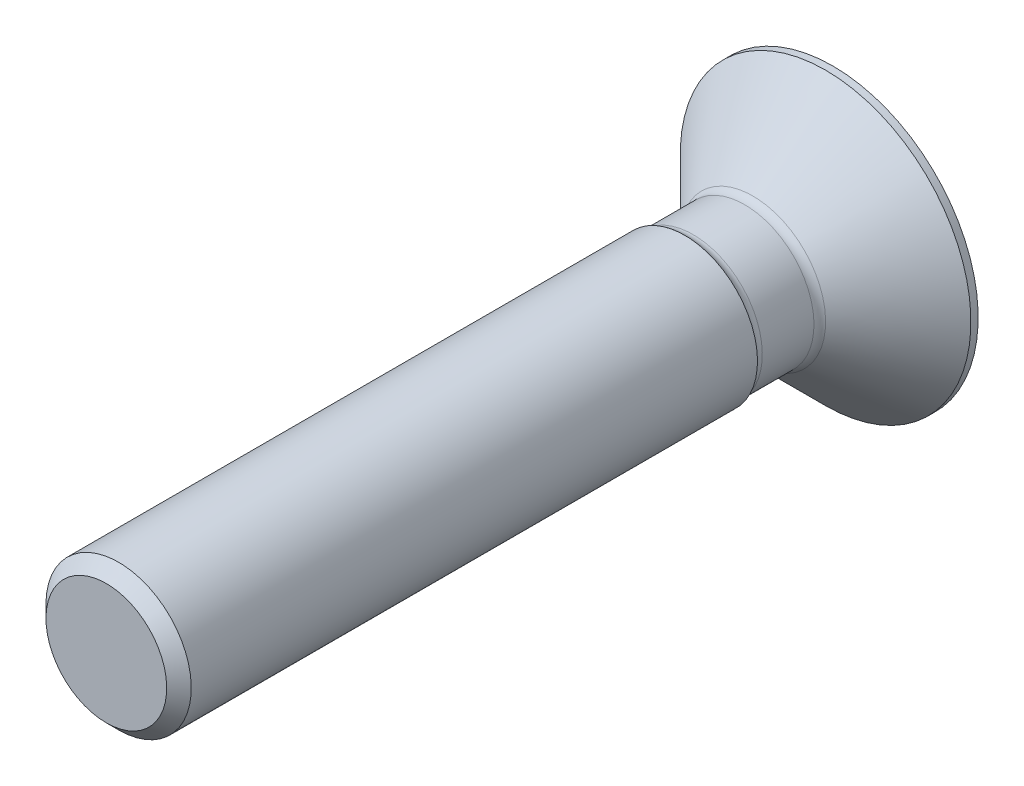
ISO-10303-21;
HEADER;
FILE_DESCRIPTION(('STEP AP214'),'2;1');
FILE_NAME('part.step','',(''),(''),'','','');
FILE_SCHEMA(('AUTOMOTIVE_DESIGN { 1 0 10303 214 1 1 1 1 }'));
ENDSEC;
DATA;
#1=APPLICATION_CONTEXT('core data for automotive mechanical design processes');
#2=APPLICATION_PROTOCOL_DEFINITION('international standard','automotive_design',2000,#1);
#3=PRODUCT_CONTEXT('',#1,'mechanical');
#4=PRODUCT('Part','Part','',(#3));
#5=PRODUCT_RELATED_PRODUCT_CATEGORY('part','',(#4));
#6=PRODUCT_DEFINITION_FORMATION('','',#4);
#7=PRODUCT_DEFINITION_CONTEXT('part definition',#1,'design');
#8=PRODUCT_DEFINITION('design','',#6,#7);
#9=PRODUCT_DEFINITION_SHAPE('','',#8);
#10=(LENGTH_UNIT() NAMED_UNIT(*) SI_UNIT(.MILLI.,.METRE.));
#11=(NAMED_UNIT(*) PLANE_ANGLE_UNIT() SI_UNIT($,.RADIAN.));
#12=(NAMED_UNIT(*) SI_UNIT($,.STERADIAN.) SOLID_ANGLE_UNIT());
#13=UNCERTAINTY_MEASURE_WITH_UNIT(LENGTH_MEASURE(1.E-05),#10,'distance_accuracy_value','');
#14=(GEOMETRIC_REPRESENTATION_CONTEXT(3) GLOBAL_UNCERTAINTY_ASSIGNED_CONTEXT((#13)) GLOBAL_UNIT_ASSIGNED_CONTEXT((#10,
#11,#12)) REPRESENTATION_CONTEXT('',''));
#15=CARTESIAN_POINT('',(0.,0.,0.));
#16=DIRECTION('',(0.,0.,1.));
#17=DIRECTION('',(1.,0.,0.));
#18=AXIS2_PLACEMENT_3D('',#15,#16,#17);
#19=CARTESIAN_POINT('',(0.,-1.66171875,35.6));
#20=DIRECTION('',(0.,0.,1.));
#21=DIRECTION('',(0.,-1.,0.));
#22=AXIS2_PLACEMENT_3D('',#19,#20,#21);
#23=PLANE('',#22);
#24=CARTESIAN_POINT('',(0.,0.,35.6));
#25=DIRECTION('',(0.,0.,1.));
#26=DIRECTION('',(0.,-1.,0.));
#27=AXIS2_PLACEMENT_3D('',#24,#25,#26);
#28=CIRCLE('',#27,3.3234375);
#29=CARTESIAN_POINT('',(0.,-3.3234375,35.6));
#30=VERTEX_POINT('',#29);
#31=EDGE_CURVE('E11',#30,#30,#28,.T.);
#32=ORIENTED_EDGE('',*,*,#31,.T.);
#33=EDGE_LOOP('',(#32));
#34=FACE_BOUND('',#33,.T.);
#35=ADVANCED_FACE('F17',(#34),#23,.T.);
#36=CARTESIAN_POINT('',(0.,0.,35.26171875));
#37=DIRECTION('',(0.,0.,-1.));
#38=DIRECTION('',(0.,-1.,0.));
#39=AXIS2_PLACEMENT_3D('',#36,#37,#38);
#40=CONICAL_SURFACE('',#39,3.66171875,0.785398163397446);
#41=CARTESIAN_POINT('',(0.,0.,34.9234375));
#42=DIRECTION('',(0.,0.,1.));
#43=DIRECTION('',(0.,-1.,0.));
#44=AXIS2_PLACEMENT_3D('',#41,#42,#43);
#45=CIRCLE('',#44,4.);
#46=CARTESIAN_POINT('',(0.,-4.,34.9234375));
#47=VERTEX_POINT('',#46);
#48=EDGE_CURVE('E27',#47,#47,#45,.T.);
#49=ORIENTED_EDGE('',*,*,#48,.T.);
#50=EDGE_LOOP('',(#49));
#51=FACE_BOUND('',#50,.T.);
#52=ORIENTED_EDGE('',*,*,#31,.F.);
#53=EDGE_LOOP('',(#52));
#54=FACE_BOUND('',#53,.T.);
#55=ADVANCED_FACE('F224',(#51,#54),#40,.T.);
#56=CARTESIAN_POINT('',(0.,0.,19.33671875));
#57=DIRECTION('',(0.,0.,-1.));
#58=DIRECTION('',(0.,-1.,0.));
#59=AXIS2_PLACEMENT_3D('',#56,#57,#58);
#60=CYLINDRICAL_SURFACE('',#59,4.);
#61=CARTESIAN_POINT('',(0.,0.,3.75));
#62=DIRECTION('',(0.,0.,1.));
#63=DIRECTION('',(0.,-1.,0.));
#64=AXIS2_PLACEMENT_3D('',#61,#62,#63);
#65=CIRCLE('',#64,4.);
#66=CARTESIAN_POINT('',(0.,-4.,3.75));
#67=VERTEX_POINT('',#66);
#68=EDGE_CURVE('E93',#67,#67,#65,.T.);
#69=ORIENTED_EDGE('',*,*,#68,.T.);
#70=EDGE_LOOP('',(#69));
#71=FACE_BOUND('',#70,.T.);
#72=ORIENTED_EDGE('',*,*,#48,.F.);
#73=EDGE_LOOP('',(#72));
#74=FACE_BOUND('',#73,.T.);
#75=ADVANCED_FACE('F94',(#71,#74),#60,.T.);
#76=CARTESIAN_POINT('',(0.,0.,3.2974516600406));
#77=DIRECTION('',(0.,0.,1.));
#78=DIRECTION('',(-1.,0.,0.));
#79=AXIS2_PLACEMENT_3D('',#76,#77,#78);
#80=TOROIDAL_SURFACE('',#79,4.4525483399594,0.64);
#81=CARTESIAN_POINT('',(0.,0.,3.2974516600406));
#82=DIRECTION('',(0.,0.,1.));
#83=DIRECTION('',(0.,-1.,0.));
#84=AXIS2_PLACEMENT_3D('',#81,#82,#83);
#85=CIRCLE('',#84,3.81254833995939);
#86=CARTESIAN_POINT('',(0.,-3.81254833995939,3.2974516600406));
#87=VERTEX_POINT('',#86);
#88=EDGE_CURVE('E89',#87,#87,#85,.T.);
#89=ORIENTED_EDGE('',*,*,#88,.T.);
#90=EDGE_LOOP('',(#89));
#91=FACE_BOUND('',#90,.T.);
#92=ORIENTED_EDGE('',*,*,#68,.F.);
#93=EDGE_LOOP('',(#92));
#94=FACE_BOUND('',#93,.T.);
#95=ADVANCED_FACE('F244',(#91,#94),#80,.F.);
#96=CARTESIAN_POINT('',(0.,0.,1.875));
#97=DIRECTION('',(0.,0.,-1.));
#98=DIRECTION('',(0.,-1.,0.));
#99=AXIS2_PLACEMENT_3D('',#96,#97,#98);
#100=CYLINDRICAL_SURFACE('',#99,3.81254833995939);
#101=CARTESIAN_POINT('',(0.,0.,0.452548339959391));
#102=DIRECTION('',(0.,0.,1.));
#103=DIRECTION('',(0.,-1.,0.));
#104=AXIS2_PLACEMENT_3D('',#101,#102,#103);
#105=CIRCLE('',#104,3.81254833995939);
#106=CARTESIAN_POINT('',(0.,-3.81254833995939,0.452548339959391));
#107=VERTEX_POINT('',#106);
#108=EDGE_CURVE('E98',#107,#107,#105,.T.);
#109=ORIENTED_EDGE('',*,*,#108,.T.);
#110=EDGE_LOOP('',(#109));
#111=FACE_BOUND('',#110,.T.);
#112=ORIENTED_EDGE('',*,*,#88,.F.);
#113=EDGE_LOOP('',(#112));
#114=FACE_BOUND('',#113,.T.);
#115=ADVANCED_FACE('F239',(#111,#114),#100,.T.);
#116=CARTESIAN_POINT('',(0.,0.,0.45254833995939));
#117=DIRECTION('',(0.,0.,1.));
#118=DIRECTION('',(-1.,0.,0.));
#119=AXIS2_PLACEMENT_3D('',#116,#117,#118);
#120=TOROIDAL_SURFACE('',#119,4.45254833995939,0.64);
#121=CARTESIAN_POINT('',(0.,0.,0.));
#122=DIRECTION('',(0.,0.,1.));
#123=DIRECTION('',(0.,-1.,0.));
#124=AXIS2_PLACEMENT_3D('',#121,#122,#123);
#125=CIRCLE('',#124,4.);
#126=CARTESIAN_POINT('',(0.,-4.,0.));
#127=VERTEX_POINT('',#126);
#128=EDGE_CURVE('E130',#127,#127,#125,.T.);
#129=ORIENTED_EDGE('',*,*,#128,.T.);
#130=EDGE_LOOP('',(#129));
#131=FACE_BOUND('',#130,.T.);
#132=ORIENTED_EDGE('',*,*,#108,.F.);
#133=EDGE_LOOP('',(#132));
#134=FACE_BOUND('',#133,.T.);
#135=ADVANCED_FACE('F236',(#131,#134),#120,.F.);
#136=CARTESIAN_POINT('',(0.,0.,-2.));
#137=DIRECTION('',(0.,0.,-1.));
#138=DIRECTION('',(0.,-1.,0.));
#139=AXIS2_PLACEMENT_3D('',#136,#137,#138);
#140=CONICAL_SURFACE('',#139,6.,0.785398163397449);
#141=CARTESIAN_POINT('',(0.,0.,-4.));
#142=DIRECTION('',(0.,0.,1.));
#143=DIRECTION('',(0.,-1.,0.));
#144=AXIS2_PLACEMENT_3D('',#141,#142,#143);
#145=CIRCLE('',#144,8.);
#146=CARTESIAN_POINT('',(0.,-8.,-4.));
#147=VERTEX_POINT('',#146);
#148=EDGE_CURVE('E128',#147,#147,#145,.T.);
#149=ORIENTED_EDGE('',*,*,#148,.T.);
#150=EDGE_LOOP('',(#149));
#151=FACE_BOUND('',#150,.T.);
#152=ORIENTED_EDGE('',*,*,#128,.F.);
#153=EDGE_LOOP('',(#152));
#154=FACE_BOUND('',#153,.T.);
#155=ADVANCED_FACE('F19',(#151,#154),#140,.T.);
#156=CARTESIAN_POINT('',(0.,0.,-4.2));
#157=DIRECTION('',(0.,0.,-1.));
#158=DIRECTION('',(0.,-1.,0.));
#159=AXIS2_PLACEMENT_3D('',#156,#157,#158);
#160=CYLINDRICAL_SURFACE('',#159,8.);
#161=CARTESIAN_POINT('',(0.,0.,-4.4));
#162=DIRECTION('',(0.,0.,1.));
#163=DIRECTION('',(0.,-1.,0.));
#164=AXIS2_PLACEMENT_3D('',#161,#162,#163);
#165=CIRCLE('',#164,8.);
#166=CARTESIAN_POINT('',(0.,-8.,-4.4));
#167=VERTEX_POINT('',#166);
#168=EDGE_CURVE('E131',#167,#167,#165,.T.);
#169=ORIENTED_EDGE('',*,*,#168,.T.);
#170=EDGE_LOOP('',(#169));
#171=FACE_BOUND('',#170,.T.);
#172=ORIENTED_EDGE('',*,*,#148,.F.);
#173=EDGE_LOOP('',(#172));
#174=FACE_BOUND('',#173,.T.);
#175=ADVANCED_FACE('F257',(#171,#174),#160,.T.);
#176=CARTESIAN_POINT('',(0.,-4.,-4.4));
#177=DIRECTION('',(0.,0.,-1.));
#178=DIRECTION('',(0.,1.,0.));
#179=AXIS2_PLACEMENT_3D('',#176,#177,#178);
#180=PLANE('',#179);
#181=ORIENTED_EDGE('',*,*,#168,.F.);
#182=EDGE_LOOP('',(#181));
#183=FACE_BOUND('',#182,.T.);
#184=DIRECTION('',(-0.5,-0.866025403784439,0.));
#185=VECTOR('',#184,1.);
#186=CARTESIAN_POINT('',(-3.03165040378444,-0.249675823286216,-4.4));
#187=LINE('',#186,#185);
#188=CARTESIAN_POINT('',(-1.44375,2.50064835342757,-4.4));
#189=VERTEX_POINT('',#188);
#190=CARTESIAN_POINT('',(-2.8875,0.,-4.4));
#191=VERTEX_POINT('',#190);
#192=EDGE_CURVE('E21',#189,#191,#187,.T.);
#193=ORIENTED_EDGE('',*,*,#192,.T.);
#194=DIRECTION('',(0.5,-0.866025403784439,0.));
#195=VECTOR('',#194,1.);
#196=CARTESIAN_POINT('',(-1.29959959621556,-2.75032417671378,-4.4));
#197=LINE('',#196,#195);
#198=CARTESIAN_POINT('',(-1.44375,-2.50064835342757,-4.4));
#199=VERTEX_POINT('',#198);
#200=EDGE_CURVE('E159',#191,#199,#197,.T.);
#201=ORIENTED_EDGE('',*,*,#200,.T.);
#202=DIRECTION('',(1.,0.,0.));
#203=VECTOR('',#202,1.);
#204=CARTESIAN_POINT('',(0.,-2.50064835342757,-4.4));
#205=LINE('',#204,#203);
#206=CARTESIAN_POINT('',(1.44375,-2.50064835342757,-4.4));
#207=VERTEX_POINT('',#206);
#208=EDGE_CURVE('E112',#199,#207,#205,.T.);
#209=ORIENTED_EDGE('',*,*,#208,.T.);
#210=DIRECTION('',(0.5,0.866025403784439,0.));
#211=VECTOR('',#210,1.);
#212=CARTESIAN_POINT('',(1.29959959621556,-2.75032417671378,-4.4));
#213=LINE('',#212,#211);
#214=CARTESIAN_POINT('',(2.8875,0.,-4.4));
#215=VERTEX_POINT('',#214);
#216=EDGE_CURVE('E113',#207,#215,#213,.T.);
#217=ORIENTED_EDGE('',*,*,#216,.T.);
#218=DIRECTION('',(-0.5,0.866025403784439,0.));
#219=VECTOR('',#218,1.);
#220=CARTESIAN_POINT('',(3.03165040378444,-0.249675823286217,-4.4));
#221=LINE('',#220,#219);
#222=CARTESIAN_POINT('',(1.44375,2.50064835342757,-4.4));
#223=VERTEX_POINT('',#222);
#224=EDGE_CURVE('E116',#215,#223,#221,.T.);
#225=ORIENTED_EDGE('',*,*,#224,.T.);
#226=DIRECTION('',(-1.,0.,0.));
#227=VECTOR('',#226,1.);
#228=CARTESIAN_POINT('',(0.,2.50064835342757,-4.4));
#229=LINE('',#228,#227);
#230=EDGE_CURVE('E117',#223,#189,#229,.T.);
#231=ORIENTED_EDGE('',*,*,#230,.T.);
#232=EDGE_LOOP('',(#193,#201,#209,#217,#225,#231));
#233=FACE_BOUND('',#232,.T.);
#234=ADVANCED_FACE('F182',(#183,#233),#180,.T.);
#235=CARTESIAN_POINT('',(-2.165625,-1.25032417671378,-4.4));
#236=DIRECTION('',(-0.866025403784439,-0.5,0.));
#237=DIRECTION('',(0.5,-0.866025403784439,0.));
#238=AXIS2_PLACEMENT_3D('',#235,#236,#237);
#239=PLANE('',#238);
#240=CARTESIAN_POINT('',(-2.8875,0.,-0.9));
#241=CARTESIAN_POINT('',(-2.165625,-1.25032417671378,-0.483225274428739));
#242=CARTESIAN_POINT('',(-1.44375,-2.50064835342757,-0.9));
#243=(BOUNDED_CURVE() B_SPLINE_CURVE(2,(#240,#241,#242),.UNSPECIFIED.,.F.,
.F.) B_SPLINE_CURVE_WITH_KNOTS((3,3),(0.,2.92184790476981),
.UNSPECIFIED.) CURVE() GEOMETRIC_REPRESENTATION_ITEM() RATIONAL_B_SPLINE_CURVE((1.,
1.15470053837925,1.)) REPRESENTATION_ITEM(''));
#244=CARTESIAN_POINT('',(-2.8875,0.,-0.9));
#245=VERTEX_POINT('',#244);
#246=CARTESIAN_POINT('',(-1.44375,-2.50064835342757,-0.9));
#247=VERTEX_POINT('',#246);
#248=EDGE_CURVE('E107',#245,#247,#243,.T.);
#249=ORIENTED_EDGE('',*,*,#248,.T.);
#250=DIRECTION('',(0.,0.,1.));
#251=VECTOR('',#250,1.);
#252=CARTESIAN_POINT('',(-1.44375,-2.50064835342757,-4.4));
#253=LINE('',#252,#251);
#254=EDGE_CURVE('E142',#199,#247,#253,.T.);
#255=ORIENTED_EDGE('',*,*,#254,.F.);
#256=ORIENTED_EDGE('',*,*,#200,.F.);
#257=DIRECTION('',(0.,0.,1.));
#258=VECTOR('',#257,1.);
#259=CARTESIAN_POINT('',(-2.8875,0.,-4.4));
#260=LINE('',#259,#258);
#261=EDGE_CURVE('E166',#191,#245,#260,.T.);
#262=ORIENTED_EDGE('',*,*,#261,.T.);
#263=EDGE_LOOP('',(#249,#255,#256,#262));
#264=FACE_BOUND('',#263,.T.);
#265=ADVANCED_FACE('F187',(#264),#239,.F.);
#266=CARTESIAN_POINT('',(0.,-2.50064835342757,-4.4));
#267=DIRECTION('',(0.,-1.,0.));
#268=DIRECTION('',(1.,0.,0.));
#269=AXIS2_PLACEMENT_3D('',#266,#267,#268);
#270=PLANE('',#269);
#271=CARTESIAN_POINT('',(-1.44375,-2.50064835342757,-0.9));
#272=CARTESIAN_POINT('',(0.,-2.50064835342756,-0.483225274428738));
#273=CARTESIAN_POINT('',(1.44375,-2.50064835342757,-0.9));
#274=(BOUNDED_CURVE() B_SPLINE_CURVE(2,(#271,#272,#273),.UNSPECIFIED.,.F.,
.F.) B_SPLINE_CURVE_WITH_KNOTS((3,3),(0.,2.92184790476982),
.UNSPECIFIED.) CURVE() GEOMETRIC_REPRESENTATION_ITEM() RATIONAL_B_SPLINE_CURVE((1.,
1.15470053837925,1.)) REPRESENTATION_ITEM(''));
#275=CARTESIAN_POINT('',(1.44375,-2.50064835342757,-0.9));
#276=VERTEX_POINT('',#275);
#277=EDGE_CURVE('E118',#247,#276,#274,.T.);
#278=ORIENTED_EDGE('',*,*,#277,.T.);
#279=DIRECTION('',(0.,0.,1.));
#280=VECTOR('',#279,1.);
#281=CARTESIAN_POINT('',(1.44375,-2.50064835342757,-4.4));
#282=LINE('',#281,#280);
#283=EDGE_CURVE('E65',#207,#276,#282,.T.);
#284=ORIENTED_EDGE('',*,*,#283,.F.);
#285=ORIENTED_EDGE('',*,*,#208,.F.);
#286=ORIENTED_EDGE('',*,*,#254,.T.);
#287=EDGE_LOOP('',(#278,#284,#285,#286));
#288=FACE_BOUND('',#287,.T.);
#289=ADVANCED_FACE('F191',(#288),#270,.F.);
#290=CARTESIAN_POINT('',(2.165625,-1.25032417671378,-4.4));
#291=DIRECTION('',(0.866025403784439,-0.5,0.));
#292=DIRECTION('',(0.5,0.866025403784439,0.));
#293=AXIS2_PLACEMENT_3D('',#290,#291,#292);
#294=PLANE('',#293);
#295=CARTESIAN_POINT('',(1.44375,-2.50064835342757,-0.9));
#296=CARTESIAN_POINT('',(2.165625,-1.25032417671378,-0.48322527442874));
#297=CARTESIAN_POINT('',(2.8875,0.,-0.9));
#298=(BOUNDED_CURVE() B_SPLINE_CURVE(2,(#295,#296,#297),.UNSPECIFIED.,.F.,
.F.) B_SPLINE_CURVE_WITH_KNOTS((3,3),(0.,2.9218479047698),
.UNSPECIFIED.) CURVE() GEOMETRIC_REPRESENTATION_ITEM() RATIONAL_B_SPLINE_CURVE((1.,
1.15470053837925,1.)) REPRESENTATION_ITEM(''));
#299=CARTESIAN_POINT('',(2.8875,0.,-0.9));
#300=VERTEX_POINT('',#299);
#301=EDGE_CURVE('E122',#276,#300,#298,.T.);
#302=ORIENTED_EDGE('',*,*,#301,.T.);
#303=DIRECTION('',(0.,0.,1.));
#304=VECTOR('',#303,1.);
#305=CARTESIAN_POINT('',(2.8875,0.,-4.4));
#306=LINE('',#305,#304);
#307=EDGE_CURVE('E123',#215,#300,#306,.T.);
#308=ORIENTED_EDGE('',*,*,#307,.F.);
#309=ORIENTED_EDGE('',*,*,#216,.F.);
#310=ORIENTED_EDGE('',*,*,#283,.T.);
#311=EDGE_LOOP('',(#302,#308,#309,#310));
#312=FACE_BOUND('',#311,.T.);
#313=ADVANCED_FACE('F195',(#312),#294,.F.);
#314=CARTESIAN_POINT('',(2.165625,1.25032417671378,-4.4));
#315=DIRECTION('',(0.866025403784439,0.5,0.));
#316=DIRECTION('',(-0.5,0.866025403784439,0.));
#317=AXIS2_PLACEMENT_3D('',#314,#315,#316);
#318=PLANE('',#317);
#319=CARTESIAN_POINT('',(2.8875,0.,-0.9));
#320=CARTESIAN_POINT('',(2.165625,1.25032417671378,-0.48322527442874));
#321=CARTESIAN_POINT('',(1.44375,2.50064835342757,-0.9));
#322=(BOUNDED_CURVE() B_SPLINE_CURVE(2,(#319,#320,#321),.UNSPECIFIED.,.F.,
.F.) B_SPLINE_CURVE_WITH_KNOTS((3,3),(0.,2.9218479047698),
.UNSPECIFIED.) CURVE() GEOMETRIC_REPRESENTATION_ITEM() RATIONAL_B_SPLINE_CURVE((1.,
1.15470053837925,1.)) REPRESENTATION_ITEM(''));
#323=CARTESIAN_POINT('',(1.44375,2.50064835342757,-0.9));
#324=VERTEX_POINT('',#323);
#325=EDGE_CURVE('E136',#300,#324,#322,.T.);
#326=ORIENTED_EDGE('',*,*,#325,.T.);
#327=DIRECTION('',(0.,0.,1.));
#328=VECTOR('',#327,1.);
#329=CARTESIAN_POINT('',(1.44375,2.50064835342757,-4.4));
#330=LINE('',#329,#328);
#331=EDGE_CURVE('E114',#223,#324,#330,.T.);
#332=ORIENTED_EDGE('',*,*,#331,.F.);
#333=ORIENTED_EDGE('',*,*,#224,.F.);
#334=ORIENTED_EDGE('',*,*,#307,.T.);
#335=EDGE_LOOP('',(#326,#332,#333,#334));
#336=FACE_BOUND('',#335,.T.);
#337=ADVANCED_FACE('F212',(#336),#318,.F.);
#338=CARTESIAN_POINT('',(0.,2.50064835342757,-4.4));
#339=DIRECTION('',(0.,1.,0.));
#340=DIRECTION('',(-1.,0.,0.));
#341=AXIS2_PLACEMENT_3D('',#338,#339,#340);
#342=PLANE('',#341);
#343=CARTESIAN_POINT('',(1.44375,2.50064835342757,-0.9));
#344=CARTESIAN_POINT('',(0.,2.50064835342756,-0.483225274428739));
#345=CARTESIAN_POINT('',(-1.44375,2.50064835342757,-0.9));
#346=(BOUNDED_CURVE() B_SPLINE_CURVE(2,(#343,#344,#345),.UNSPECIFIED.,.F.,
.F.) B_SPLINE_CURVE_WITH_KNOTS((3,3),(0.,2.92184790476981),
.UNSPECIFIED.) CURVE() GEOMETRIC_REPRESENTATION_ITEM() RATIONAL_B_SPLINE_CURVE((1.,
1.15470053837925,1.)) REPRESENTATION_ITEM(''));
#347=CARTESIAN_POINT('',(-1.44375,2.50064835342757,-0.9));
#348=VERTEX_POINT('',#347);
#349=EDGE_CURVE('E106',#324,#348,#346,.T.);
#350=ORIENTED_EDGE('',*,*,#349,.T.);
#351=DIRECTION('',(0.,0.,1.));
#352=VECTOR('',#351,1.);
#353=CARTESIAN_POINT('',(-1.44375,2.50064835342757,-4.4));
#354=LINE('',#353,#352);
#355=EDGE_CURVE('E171',#189,#348,#354,.T.);
#356=ORIENTED_EDGE('',*,*,#355,.F.);
#357=ORIENTED_EDGE('',*,*,#230,.F.);
#358=ORIENTED_EDGE('',*,*,#331,.T.);
#359=EDGE_LOOP('',(#350,#356,#357,#358));
#360=FACE_BOUND('',#359,.T.);
#361=ADVANCED_FACE('F207',(#360),#342,.F.);
#362=CARTESIAN_POINT('',(-2.165625,1.25032417671378,-4.4));
#363=DIRECTION('',(-0.866025403784439,0.5,0.));
#364=DIRECTION('',(-0.5,-0.866025403784439,0.));
#365=AXIS2_PLACEMENT_3D('',#362,#363,#364);
#366=PLANE('',#365);
#367=CARTESIAN_POINT('',(-1.44375,2.50064835342757,-0.9));
#368=CARTESIAN_POINT('',(-2.165625,1.25032417671378,-0.48322527442874));
#369=CARTESIAN_POINT('',(-2.8875,0.,-0.9));
#370=(BOUNDED_CURVE() B_SPLINE_CURVE(2,(#367,#368,#369),.UNSPECIFIED.,.F.,
.F.) B_SPLINE_CURVE_WITH_KNOTS((3,3),(0.,2.9218479047698),
.UNSPECIFIED.) CURVE() GEOMETRIC_REPRESENTATION_ITEM() RATIONAL_B_SPLINE_CURVE((1.,
1.15470053837925,1.)) REPRESENTATION_ITEM(''));
#371=EDGE_CURVE('E101',#348,#245,#370,.T.);
#372=ORIENTED_EDGE('',*,*,#371,.T.);
#373=ORIENTED_EDGE('',*,*,#261,.F.);
#374=ORIENTED_EDGE('',*,*,#192,.F.);
#375=ORIENTED_EDGE('',*,*,#355,.T.);
#376=EDGE_LOOP('',(#372,#373,#374,#375));
#377=FACE_BOUND('',#376,.T.);
#378=ADVANCED_FACE('F202',(#377),#366,.F.);
#379=CARTESIAN_POINT('',(0.,0.,-0.0664505488574783));
#380=DIRECTION('',(0.,0.,-1.));
#381=DIRECTION('',(0.,-1.,0.));
#382=AXIS2_PLACEMENT_3D('',#379,#380,#381);
#383=CONICAL_SURFACE('',#382,1.44375,1.0471975511966);
#384=CARTESIAN_POINT('',(0.,0.,0.767098902285044));
#385=VERTEX_POINT('',#384);
#386=VERTEX_LOOP('',#385);
#387=FACE_BOUND('',#386,.T.);
#388=ORIENTED_EDGE('',*,*,#301,.F.);
#389=ORIENTED_EDGE('',*,*,#277,.F.);
#390=ORIENTED_EDGE('',*,*,#248,.F.);
#391=ORIENTED_EDGE('',*,*,#371,.F.);
#392=ORIENTED_EDGE('',*,*,#349,.F.);
#393=ORIENTED_EDGE('',*,*,#325,.F.);
#394=EDGE_LOOP('',(#388,#389,#390,#391,#392,#393));
#395=FACE_BOUND('',#394,.T.);
#396=ADVANCED_FACE('F210',(#387,#395),#383,.F.);
#397=CLOSED_SHELL('',(#35,#55,#75,#95,#115,#135,#155,#175,#234,#265,#289,#313,#337,#361,#378,#396));
#398=MANIFOLD_SOLID_BREP('B1',#397);
#399=ADVANCED_BREP_SHAPE_REPRESENTATION('',(#18,#398),#14);
#400=SHAPE_DEFINITION_REPRESENTATION(#9,#399);
ENDSEC;
END-ISO-10303-21;
